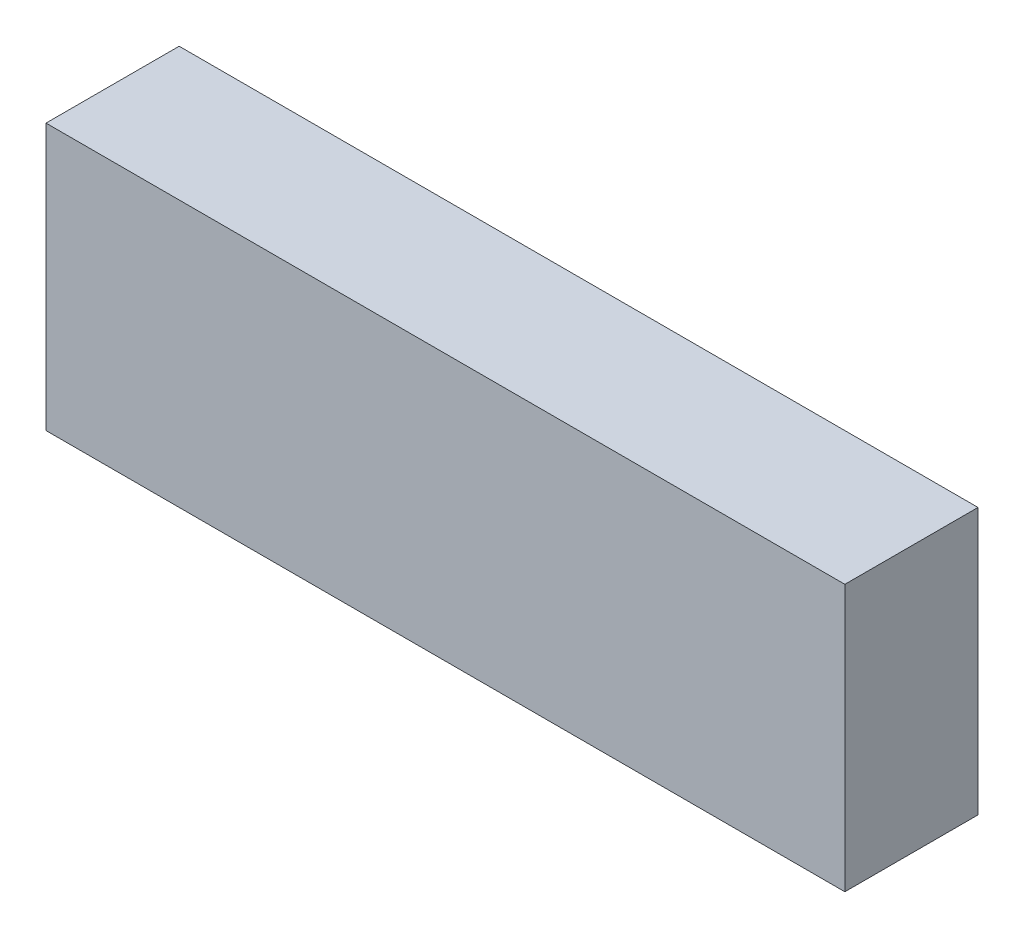
ISO-10303-21;
HEADER;
FILE_DESCRIPTION(('STEP AP214'),'2;1');
FILE_NAME('part.step','',(''),(''),'','','');
FILE_SCHEMA(('AUTOMOTIVE_DESIGN { 1 0 10303 214 1 1 1 1 }'));
ENDSEC;
DATA;
#1=APPLICATION_CONTEXT('core data for automotive mechanical design processes');
#2=APPLICATION_PROTOCOL_DEFINITION('international standard','automotive_design',2000,#1);
#3=PRODUCT_CONTEXT('',#1,'mechanical');
#4=PRODUCT('Part','Part','',(#3));
#5=PRODUCT_RELATED_PRODUCT_CATEGORY('part','',(#4));
#6=PRODUCT_DEFINITION_FORMATION('','',#4);
#7=PRODUCT_DEFINITION_CONTEXT('part definition',#1,'design');
#8=PRODUCT_DEFINITION('design','',#6,#7);
#9=PRODUCT_DEFINITION_SHAPE('','',#8);
#10=(LENGTH_UNIT() NAMED_UNIT(*) SI_UNIT(.MILLI.,.METRE.));
#11=(NAMED_UNIT(*) PLANE_ANGLE_UNIT() SI_UNIT($,.RADIAN.));
#12=(NAMED_UNIT(*) SI_UNIT($,.STERADIAN.) SOLID_ANGLE_UNIT());
#13=UNCERTAINTY_MEASURE_WITH_UNIT(LENGTH_MEASURE(1.E-05),#10,'distance_accuracy_value','');
#14=(GEOMETRIC_REPRESENTATION_CONTEXT(3) GLOBAL_UNCERTAINTY_ASSIGNED_CONTEXT((#13)) GLOBAL_UNIT_ASSIGNED_CONTEXT((#10,
#11,#12)) REPRESENTATION_CONTEXT('',''));
#15=CARTESIAN_POINT('',(0.,0.,0.));
#16=DIRECTION('',(0.,0.,1.));
#17=DIRECTION('',(1.,0.,0.));
#18=AXIS2_PLACEMENT_3D('',#15,#16,#17);
#19=CARTESIAN_POINT('',(-1.975,1.675,0.));
#20=DIRECTION('',(1.,0.,0.));
#21=DIRECTION('',(0.,0.,1.));
#22=AXIS2_PLACEMENT_3D('',#19,#20,#21);
#23=PLANE('',#22);
#24=DIRECTION('',(0.,1.,0.));
#25=VECTOR('',#24,1.);
#26=CARTESIAN_POINT('',(-1.975,1.675,0.1));
#27=LINE('',#26,#25);
#28=CARTESIAN_POINT('',(-1.975,1.675,0.1));
#29=VERTEX_POINT('',#28);
#30=CARTESIAN_POINT('',(-1.975,1.875,0.1));
#31=VERTEX_POINT('',#30);
#32=EDGE_CURVE('E11',#29,#31,#27,.T.);
#33=ORIENTED_EDGE('',*,*,#32,.T.);
#34=DIRECTION('',(0.,0.,1.));
#35=VECTOR('',#34,1.);
#36=CARTESIAN_POINT('',(-1.975,1.875,0.));
#37=LINE('',#36,#35);
#38=CARTESIAN_POINT('',(-1.975,1.875,0.));
#39=VERTEX_POINT('',#38);
#40=EDGE_CURVE('E24',#39,#31,#37,.T.);
#41=ORIENTED_EDGE('',*,*,#40,.F.);
#42=DIRECTION('',(0.,1.,0.));
#43=VECTOR('',#42,1.);
#44=CARTESIAN_POINT('',(-1.975,1.675,0.));
#45=LINE('',#44,#43);
#46=CARTESIAN_POINT('',(-1.975,1.675,0.));
#47=VERTEX_POINT('',#46);
#48=EDGE_CURVE('E86',#47,#39,#45,.T.);
#49=ORIENTED_EDGE('',*,*,#48,.F.);
#50=DIRECTION('',(0.,0.,1.));
#51=VECTOR('',#50,1.);
#52=CARTESIAN_POINT('',(-1.975,1.675,0.));
#53=LINE('',#52,#51);
#54=EDGE_CURVE('E36',#47,#29,#53,.T.);
#55=ORIENTED_EDGE('',*,*,#54,.T.);
#56=EDGE_LOOP('',(#33,#41,#49,#55));
#57=FACE_BOUND('',#56,.T.);
#58=ADVANCED_FACE('F17',(#57),#23,.F.);
#59=CARTESIAN_POINT('',(-1.375,1.675,0.));
#60=DIRECTION('',(1.,0.,0.));
#61=DIRECTION('',(0.,0.,1.));
#62=AXIS2_PLACEMENT_3D('',#59,#60,#61);
#63=PLANE('',#62);
#64=DIRECTION('',(0.,0.,1.));
#65=VECTOR('',#64,1.);
#66=CARTESIAN_POINT('',(-1.375,1.675,0.));
#67=LINE('',#66,#65);
#68=CARTESIAN_POINT('',(-1.375,1.675,0.));
#69=VERTEX_POINT('',#68);
#70=CARTESIAN_POINT('',(-1.375,1.675,0.1));
#71=VERTEX_POINT('',#70);
#72=EDGE_CURVE('E83',#69,#71,#67,.T.);
#73=ORIENTED_EDGE('',*,*,#72,.F.);
#74=DIRECTION('',(0.,1.,0.));
#75=VECTOR('',#74,1.);
#76=CARTESIAN_POINT('',(-1.375,1.675,0.));
#77=LINE('',#76,#75);
#78=CARTESIAN_POINT('',(-1.375,1.875,0.));
#79=VERTEX_POINT('',#78);
#80=EDGE_CURVE('E63',#69,#79,#77,.T.);
#81=ORIENTED_EDGE('',*,*,#80,.T.);
#82=DIRECTION('',(0.,0.,1.));
#83=VECTOR('',#82,1.);
#84=CARTESIAN_POINT('',(-1.375,1.875,0.));
#85=LINE('',#84,#83);
#86=CARTESIAN_POINT('',(-1.375,1.875,0.1));
#87=VERTEX_POINT('',#86);
#88=EDGE_CURVE('E57',#79,#87,#85,.T.);
#89=ORIENTED_EDGE('',*,*,#88,.T.);
#90=DIRECTION('',(0.,1.,0.));
#91=VECTOR('',#90,1.);
#92=CARTESIAN_POINT('',(-1.375,1.675,0.1));
#93=LINE('',#92,#91);
#94=EDGE_CURVE('E60',#71,#87,#93,.T.);
#95=ORIENTED_EDGE('',*,*,#94,.F.);
#96=EDGE_LOOP('',(#73,#81,#89,#95));
#97=FACE_BOUND('',#96,.T.);
#98=ADVANCED_FACE('F59',(#97),#63,.T.);
#99=CARTESIAN_POINT('',(-1.975,1.675,0.));
#100=DIRECTION('',(0.,1.,0.));
#101=DIRECTION('',(0.,0.,1.));
#102=AXIS2_PLACEMENT_3D('',#99,#100,#101);
#103=PLANE('',#102);
#104=ORIENTED_EDGE('',*,*,#72,.T.);
#105=DIRECTION('',(1.,0.,0.));
#106=VECTOR('',#105,1.);
#107=CARTESIAN_POINT('',(-1.975,1.675,0.1));
#108=LINE('',#107,#106);
#109=EDGE_CURVE('E71',#29,#71,#108,.T.);
#110=ORIENTED_EDGE('',*,*,#109,.F.);
#111=ORIENTED_EDGE('',*,*,#54,.F.);
#112=DIRECTION('',(1.,0.,0.));
#113=VECTOR('',#112,1.);
#114=CARTESIAN_POINT('',(-1.975,1.675,0.));
#115=LINE('',#114,#113);
#116=EDGE_CURVE('E76',#47,#69,#115,.T.);
#117=ORIENTED_EDGE('',*,*,#116,.T.);
#118=EDGE_LOOP('',(#104,#110,#111,#117));
#119=FACE_BOUND('',#118,.T.);
#120=ADVANCED_FACE('F91',(#119),#103,.F.);
#121=CARTESIAN_POINT('',(-1.975,1.875,0.));
#122=DIRECTION('',(0.,1.,0.));
#123=DIRECTION('',(0.,0.,1.));
#124=AXIS2_PLACEMENT_3D('',#121,#122,#123);
#125=PLANE('',#124);
#126=DIRECTION('',(1.,0.,0.));
#127=VECTOR('',#126,1.);
#128=CARTESIAN_POINT('',(-1.975,1.875,0.));
#129=LINE('',#128,#127);
#130=EDGE_CURVE('E74',#39,#79,#129,.T.);
#131=ORIENTED_EDGE('',*,*,#130,.F.);
#132=ORIENTED_EDGE('',*,*,#40,.T.);
#133=DIRECTION('',(1.,0.,0.));
#134=VECTOR('',#133,1.);
#135=CARTESIAN_POINT('',(-1.975,1.875,0.1));
#136=LINE('',#135,#134);
#137=EDGE_CURVE('E69',#31,#87,#136,.T.);
#138=ORIENTED_EDGE('',*,*,#137,.T.);
#139=ORIENTED_EDGE('',*,*,#88,.F.);
#140=EDGE_LOOP('',(#131,#132,#138,#139));
#141=FACE_BOUND('',#140,.T.);
#142=ADVANCED_FACE('F73',(#141),#125,.T.);
#143=CARTESIAN_POINT('',(-1.975,1.675,0.));
#144=DIRECTION('',(0.,0.,1.));
#145=DIRECTION('',(1.,0.,0.));
#146=AXIS2_PLACEMENT_3D('',#143,#144,#145);
#147=PLANE('',#146);
#148=ORIENTED_EDGE('',*,*,#130,.T.);
#149=ORIENTED_EDGE('',*,*,#80,.F.);
#150=ORIENTED_EDGE('',*,*,#116,.F.);
#151=ORIENTED_EDGE('',*,*,#48,.T.);
#152=EDGE_LOOP('',(#148,#149,#150,#151));
#153=FACE_BOUND('',#152,.T.);
#154=ADVANCED_FACE('F89',(#153),#147,.F.);
#155=CARTESIAN_POINT('',(-1.975,1.675,0.1));
#156=DIRECTION('',(0.,0.,1.));
#157=DIRECTION('',(1.,0.,0.));
#158=AXIS2_PLACEMENT_3D('',#155,#156,#157);
#159=PLANE('',#158);
#160=ORIENTED_EDGE('',*,*,#32,.F.);
#161=ORIENTED_EDGE('',*,*,#109,.T.);
#162=ORIENTED_EDGE('',*,*,#94,.T.);
#163=ORIENTED_EDGE('',*,*,#137,.F.);
#164=EDGE_LOOP('',(#160,#161,#162,#163));
#165=FACE_BOUND('',#164,.T.);
#166=ADVANCED_FACE('F68',(#165),#159,.T.);
#167=CLOSED_SHELL('',(#58,#98,#120,#142,#154,#166));
#168=MANIFOLD_SOLID_BREP('B1',#167);
#169=ADVANCED_BREP_SHAPE_REPRESENTATION('',(#18,#168),#14);
#170=SHAPE_DEFINITION_REPRESENTATION(#9,#169);
ENDSEC;
END-ISO-10303-21;
